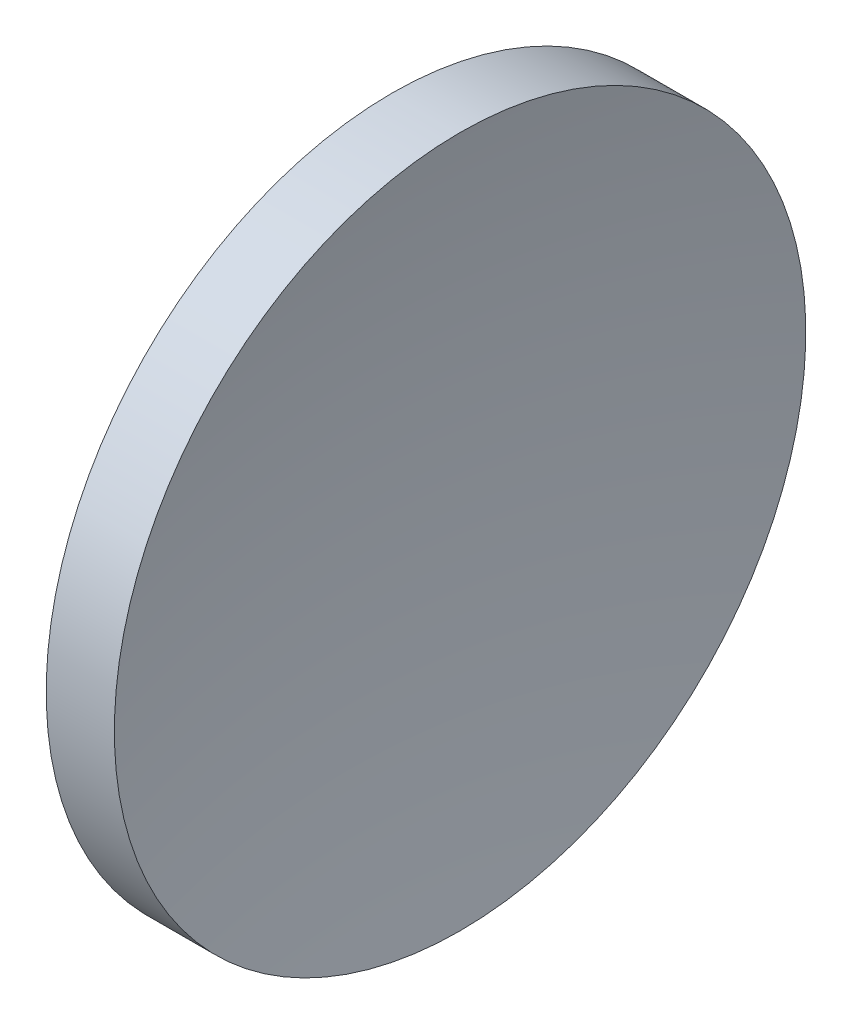
ISO-10303-21;
HEADER;
FILE_DESCRIPTION(('STEP AP214'),'2;1');
FILE_NAME('part.step','',(''),(''),'','','');
FILE_SCHEMA(('AUTOMOTIVE_DESIGN { 1 0 10303 214 1 1 1 1 }'));
ENDSEC;
DATA;
#1=APPLICATION_CONTEXT('core data for automotive mechanical design processes');
#2=APPLICATION_PROTOCOL_DEFINITION('international standard','automotive_design',2000,#1);
#3=PRODUCT_CONTEXT('',#1,'mechanical');
#4=PRODUCT('Part','Part','',(#3));
#5=PRODUCT_RELATED_PRODUCT_CATEGORY('part','',(#4));
#6=PRODUCT_DEFINITION_FORMATION('','',#4);
#7=PRODUCT_DEFINITION_CONTEXT('part definition',#1,'design');
#8=PRODUCT_DEFINITION('design','',#6,#7);
#9=PRODUCT_DEFINITION_SHAPE('','',#8);
#10=(LENGTH_UNIT() NAMED_UNIT(*) SI_UNIT(.MILLI.,.METRE.));
#11=(NAMED_UNIT(*) PLANE_ANGLE_UNIT() SI_UNIT($,.RADIAN.));
#12=(NAMED_UNIT(*) SI_UNIT($,.STERADIAN.) SOLID_ANGLE_UNIT());
#13=UNCERTAINTY_MEASURE_WITH_UNIT(LENGTH_MEASURE(1.E-05),#10,'distance_accuracy_value','');
#14=(GEOMETRIC_REPRESENTATION_CONTEXT(3) GLOBAL_UNCERTAINTY_ASSIGNED_CONTEXT((#13)) GLOBAL_UNIT_ASSIGNED_CONTEXT((#10,
#11,#12)) REPRESENTATION_CONTEXT('',''));
#15=CARTESIAN_POINT('',(0.,0.,0.));
#16=DIRECTION('',(0.,0.,1.));
#17=DIRECTION('',(1.,0.,0.));
#18=AXIS2_PLACEMENT_3D('',#15,#16,#17);
#19=CARTESIAN_POINT('',(191.61219348331,65.2168404709403,0.));
#20=DIRECTION('',(-1.,0.,0.));
#21=DIRECTION('',(0.,1.,0.));
#22=AXIS2_PLACEMENT_3D('',#19,#20,#21);
#23=SPHERICAL_SURFACE('',#22,64.2);
#24=CARTESIAN_POINT('',(128.64085079475,65.2168404709403,0.));
#25=DIRECTION('',(-1.,0.,0.));
#26=DIRECTION('',(0.,-1.,0.));
#27=AXIS2_PLACEMENT_3D('',#24,#25,#26);
#28=CIRCLE('',#27,12.5);
#29=CARTESIAN_POINT('',(128.64085079475,52.7168404709403,0.));
#30=VERTEX_POINT('',#29);
#31=EDGE_CURVE('E10',#30,#30,#28,.T.);
#32=ORIENTED_EDGE('',*,*,#31,.F.);
#33=EDGE_LOOP('',(#32));
#34=FACE_BOUND('',#33,.T.);
#35=ADVANCED_FACE('F35',(#34),#23,.F.);
#36=CARTESIAN_POINT('',(115.944491297963,65.2168404709403,0.));
#37=DIRECTION('',(-1.,0.,0.));
#38=DIRECTION('',(0.,-1.,0.));
#39=AXIS2_PLACEMENT_3D('',#36,#37,#38);
#40=CYLINDRICAL_SURFACE('',#39,12.5);
#41=CARTESIAN_POINT('',(126.17665298065,65.2168404709403,0.));
#42=DIRECTION('',(-1.,0.,0.));
#43=DIRECTION('',(0.,-1.,0.));
#44=AXIS2_PLACEMENT_3D('',#41,#42,#43);
#45=CIRCLE('',#44,12.5);
#46=CARTESIAN_POINT('',(126.17665298065,52.7168404709403,0.));
#47=VERTEX_POINT('',#46);
#48=EDGE_CURVE('E41',#47,#47,#45,.T.);
#49=ORIENTED_EDGE('',*,*,#48,.F.);
#50=EDGE_LOOP('',(#49));
#51=FACE_BOUND('',#50,.T.);
#52=ORIENTED_EDGE('',*,*,#31,.T.);
#53=EDGE_LOOP('',(#52));
#54=FACE_BOUND('',#53,.T.);
#55=ADVANCED_FACE('F49',(#51,#54),#40,.T.);
#56=CARTESIAN_POINT('',(146.312193698495,65.2168404709403,0.));
#57=DIRECTION('',(-1.,0.,0.));
#58=DIRECTION('',(0.,1.,0.));
#59=AXIS2_PLACEMENT_3D('',#56,#57,#58);
#60=SPHERICAL_SURFACE('',#59,23.7);
#61=ORIENTED_EDGE('',*,*,#48,.T.);
#62=EDGE_LOOP('',(#61));
#63=FACE_BOUND('',#62,.T.);
#64=ADVANCED_FACE('F47',(#63),#60,.T.);
#65=CLOSED_SHELL('',(#35,#55,#64));
#66=MANIFOLD_SOLID_BREP('B2',#65);
#67=ADVANCED_BREP_SHAPE_REPRESENTATION('',(#18,#66),#14);
#68=SHAPE_DEFINITION_REPRESENTATION(#9,#67);
ENDSEC;
END-ISO-10303-21;
